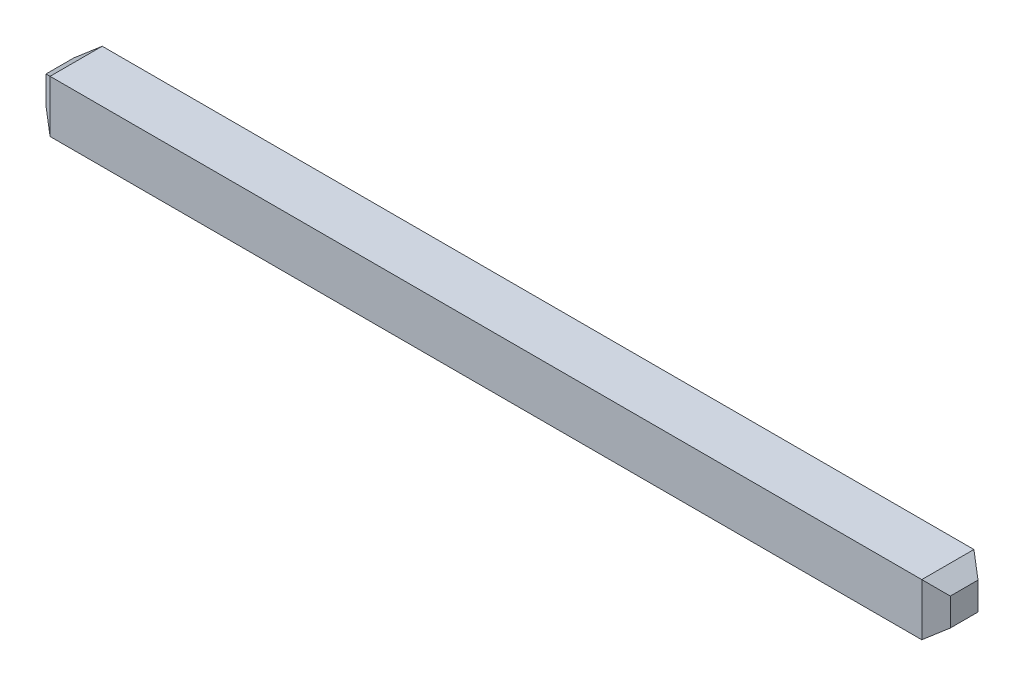
ISO-10303-21;
HEADER;
FILE_DESCRIPTION(('STEP AP214'),'2;1');
FILE_NAME('part.step','',(''),(''),'','','');
FILE_SCHEMA(('AUTOMOTIVE_DESIGN { 1 0 10303 214 1 1 1 1 }'));
ENDSEC;
DATA;
#1=APPLICATION_CONTEXT('core data for automotive mechanical design processes');
#2=APPLICATION_PROTOCOL_DEFINITION('international standard','automotive_design',2000,#1);
#3=PRODUCT_CONTEXT('',#1,'mechanical');
#4=PRODUCT('Part','Part','',(#3));
#5=PRODUCT_RELATED_PRODUCT_CATEGORY('part','',(#4));
#6=PRODUCT_DEFINITION_FORMATION('','',#4);
#7=PRODUCT_DEFINITION_CONTEXT('part definition',#1,'design');
#8=PRODUCT_DEFINITION('design','',#6,#7);
#9=PRODUCT_DEFINITION_SHAPE('','',#8);
#10=(LENGTH_UNIT() NAMED_UNIT(*) SI_UNIT(.MILLI.,.METRE.));
#11=(NAMED_UNIT(*) PLANE_ANGLE_UNIT() SI_UNIT($,.RADIAN.));
#12=(NAMED_UNIT(*) SI_UNIT($,.STERADIAN.) SOLID_ANGLE_UNIT());
#13=UNCERTAINTY_MEASURE_WITH_UNIT(LENGTH_MEASURE(1.E-05),#10,'distance_accuracy_value','');
#14=(GEOMETRIC_REPRESENTATION_CONTEXT(3) GLOBAL_UNCERTAINTY_ASSIGNED_CONTEXT((#13)) GLOBAL_UNIT_ASSIGNED_CONTEXT((#10,
#11,#12)) REPRESENTATION_CONTEXT('',''));
#15=CARTESIAN_POINT('',(0.,0.,0.));
#16=DIRECTION('',(0.,0.,1.));
#17=DIRECTION('',(1.,0.,0.));
#18=AXIS2_PLACEMENT_3D('',#15,#16,#17);
#19=CARTESIAN_POINT('',(-2.4,3.77,-39.615));
#20=DIRECTION('',(0.599999999990736,0.,0.800000000006948));
#21=DIRECTION('',(0.800000000006948,0.,-0.599999999990736));
#22=AXIS2_PLACEMENT_3D('',#19,#20,#21);
#23=PLANE('',#22);
#24=DIRECTION('',(0.,1.,0.));
#25=VECTOR('',#24,1.);
#26=CARTESIAN_POINT('',(-2.3,3.77,-39.69));
#27=LINE('',#26,#25);
#28=CARTESIAN_POINT('',(-2.29999999999957,4.09,-39.6899999999994));
#29=VERTEX_POINT('',#28);
#30=CARTESIAN_POINT('',(-2.29999999999957,3.45,-39.6899999999994));
#31=VERTEX_POINT('',#30);
#32=EDGE_CURVE('E101',#29,#31,#27,.F.);
#33=ORIENTED_EDGE('',*,*,#32,.T.);
#34=DIRECTION('',(-0.685994340570039,0.514495755427529,0.51449575542752));
#35=VECTOR('',#34,1.);
#36=CARTESIAN_POINT('',(-2.3,3.45,-39.69));
#37=LINE('',#36,#35);
#38=CARTESIAN_POINT('',(-2.50000000000022,3.6,-39.5400000000003));
#39=VERTEX_POINT('',#38);
#40=EDGE_CURVE('E85',#31,#39,#37,.T.);
#41=ORIENTED_EDGE('',*,*,#40,.T.);
#42=DIRECTION('',(0.,1.,0.));
#43=VECTOR('',#42,1.);
#44=CARTESIAN_POINT('',(-2.5,3.77,-39.54));
#45=LINE('',#44,#43);
#46=CARTESIAN_POINT('',(-2.50000000000044,3.94,-39.5400000000006));
#47=VERTEX_POINT('',#46);
#48=EDGE_CURVE('E79',#39,#47,#45,.T.);
#49=ORIENTED_EDGE('',*,*,#48,.T.);
#50=DIRECTION('',(-0.685994340570039,-0.514495755427529,0.51449575542752));
#51=VECTOR('',#50,1.);
#52=CARTESIAN_POINT('',(-2.3,4.09,-39.69));
#53=LINE('',#52,#51);
#54=EDGE_CURVE('E20',#29,#47,#53,.T.);
#55=ORIENTED_EDGE('',*,*,#54,.F.);
#56=EDGE_LOOP('',(#33,#41,#49,#55));
#57=FACE_BOUND('',#56,.T.);
#58=ADVANCED_FACE('F17',(#57),#23,.F.);
#59=CARTESIAN_POINT('',(8.5,3.77,-39.615));
#60=DIRECTION('',(-0.599999999990736,0.,0.800000000006948));
#61=DIRECTION('',(0.800000000006948,0.,0.599999999990736));
#62=AXIS2_PLACEMENT_3D('',#59,#60,#61);
#63=PLANE('',#62);
#64=DIRECTION('',(0.,1.,0.));
#65=VECTOR('',#64,1.);
#66=CARTESIAN_POINT('',(8.6,3.77,-39.54));
#67=LINE('',#66,#65);
#68=CARTESIAN_POINT('',(8.60000000000022,3.6,-39.5400000000003));
#69=VERTEX_POINT('',#68);
#70=CARTESIAN_POINT('',(8.60000000000044,3.94,-39.5400000000006));
#71=VERTEX_POINT('',#70);
#72=EDGE_CURVE('E113',#69,#71,#67,.T.);
#73=ORIENTED_EDGE('',*,*,#72,.F.);
#74=DIRECTION('',(-0.685994340570037,-0.514495755427528,-0.514495755427522));
#75=VECTOR('',#74,1.);
#76=CARTESIAN_POINT('',(8.6,3.6,-39.54));
#77=LINE('',#76,#75);
#78=CARTESIAN_POINT('',(8.39999999999957,3.45,-39.6899999999994));
#79=VERTEX_POINT('',#78);
#80=EDGE_CURVE('E108',#69,#79,#77,.T.);
#81=ORIENTED_EDGE('',*,*,#80,.T.);
#82=DIRECTION('',(0.,1.,0.));
#83=VECTOR('',#82,1.);
#84=CARTESIAN_POINT('',(8.4,3.77,-39.69));
#85=LINE('',#84,#83);
#86=CARTESIAN_POINT('',(8.39999999999957,4.09,-39.6899999999994));
#87=VERTEX_POINT('',#86);
#88=EDGE_CURVE('E99',#79,#87,#85,.T.);
#89=ORIENTED_EDGE('',*,*,#88,.T.);
#90=DIRECTION('',(-0.685994340570037,0.514495755427528,-0.514495755427522));
#91=VECTOR('',#90,1.);
#92=CARTESIAN_POINT('',(8.6,3.94,-39.54));
#93=LINE('',#92,#91);
#94=EDGE_CURVE('E116',#71,#87,#93,.T.);
#95=ORIENTED_EDGE('',*,*,#94,.F.);
#96=EDGE_LOOP('',(#73,#81,#89,#95));
#97=FACE_BOUND('',#96,.T.);
#98=ADVANCED_FACE('F214',(#97),#63,.F.);
#99=CARTESIAN_POINT('',(-2.4,4.015,-39.37));
#100=DIRECTION('',(-0.6,0.8,0.));
#101=DIRECTION('',(-0.8,-0.6,0.));
#102=AXIS2_PLACEMENT_3D('',#99,#100,#101);
#103=PLANE('',#102);
#104=DIRECTION('',(-0.685994340575995,-0.514495755427521,-0.514495755419586));
#105=VECTOR('',#104,1.);
#106=CARTESIAN_POINT('',(-2.29999999999913,4.09,-39.0500000000012));
#107=LINE('',#106,#105);
#108=CARTESIAN_POINT('',(-2.29999999999989,4.09,-39.0500000000001));
#109=VERTEX_POINT('',#108);
#110=CARTESIAN_POINT('',(-2.50000000000022,3.94,-39.1999999999997));
#111=VERTEX_POINT('',#110);
#112=EDGE_CURVE('E128',#109,#111,#107,.T.);
#113=ORIENTED_EDGE('',*,*,#112,.F.);
#114=DIRECTION('',(0.,0.,1.));
#115=VECTOR('',#114,1.);
#116=CARTESIAN_POINT('',(-2.3,4.09,-39.37));
#117=LINE('',#116,#115);
#118=EDGE_CURVE('E93',#29,#109,#117,.T.);
#119=ORIENTED_EDGE('',*,*,#118,.F.);
#120=ORIENTED_EDGE('',*,*,#54,.T.);
#121=DIRECTION('',(0.,0.,-1.));
#122=VECTOR('',#121,1.);
#123=CARTESIAN_POINT('',(-2.5,3.94,-39.37));
#124=LINE('',#123,#122);
#125=EDGE_CURVE('E87',#47,#111,#124,.F.);
#126=ORIENTED_EDGE('',*,*,#125,.T.);
#127=EDGE_LOOP('',(#113,#119,#120,#126));
#128=FACE_BOUND('',#127,.T.);
#129=ADVANCED_FACE('F90',(#128),#103,.T.);
#130=CARTESIAN_POINT('',(-2.5,3.77,-39.37));
#131=DIRECTION('',(1.,0.,0.));
#132=DIRECTION('',(0.,0.,-1.));
#133=AXIS2_PLACEMENT_3D('',#130,#131,#132);
#134=PLANE('',#133);
#135=DIRECTION('',(0.,1.,0.));
#136=VECTOR('',#135,1.);
#137=CARTESIAN_POINT('',(-2.50000000000087,3.77,-39.1999999999988));
#138=LINE('',#137,#136);
#139=CARTESIAN_POINT('',(-2.50000000000022,3.6,-39.1999999999997));
#140=VERTEX_POINT('',#139);
#141=EDGE_CURVE('E97',#111,#140,#138,.F.);
#142=ORIENTED_EDGE('',*,*,#141,.F.);
#143=ORIENTED_EDGE('',*,*,#125,.F.);
#144=ORIENTED_EDGE('',*,*,#48,.F.);
#145=DIRECTION('',(0.,0.,1.));
#146=VECTOR('',#145,1.);
#147=CARTESIAN_POINT('',(-2.5,3.6,-39.37));
#148=LINE('',#147,#146);
#149=EDGE_CURVE('E105',#39,#140,#148,.T.);
#150=ORIENTED_EDGE('',*,*,#149,.T.);
#151=EDGE_LOOP('',(#142,#143,#144,#150));
#152=FACE_BOUND('',#151,.T.);
#153=ADVANCED_FACE('F95',(#152),#134,.F.);
#154=CARTESIAN_POINT('',(3.05,3.77,-39.69));
#155=DIRECTION('',(0.,0.,1.));
#156=DIRECTION('',(1.,0.,0.));
#157=AXIS2_PLACEMENT_3D('',#154,#155,#156);
#158=PLANE('',#157);
#159=ORIENTED_EDGE('',*,*,#32,.F.);
#160=DIRECTION('',(1.,0.,0.));
#161=VECTOR('',#160,1.);
#162=CARTESIAN_POINT('',(3.05,4.09,-39.69));
#163=LINE('',#162,#161);
#164=EDGE_CURVE('E122',#87,#29,#163,.F.);
#165=ORIENTED_EDGE('',*,*,#164,.F.);
#166=ORIENTED_EDGE('',*,*,#88,.F.);
#167=DIRECTION('',(1.,0.,0.));
#168=VECTOR('',#167,1.);
#169=CARTESIAN_POINT('',(3.05,3.45,-39.69));
#170=LINE('',#169,#168);
#171=EDGE_CURVE('E136',#79,#31,#170,.F.);
#172=ORIENTED_EDGE('',*,*,#171,.T.);
#173=EDGE_LOOP('',(#159,#165,#166,#172));
#174=FACE_BOUND('',#173,.T.);
#175=ADVANCED_FACE('F182',(#174),#158,.F.);
#176=CARTESIAN_POINT('',(-2.4,3.525,-39.37));
#177=DIRECTION('',(0.6,0.8,0.));
#178=DIRECTION('',(-0.8,0.6,0.));
#179=AXIS2_PLACEMENT_3D('',#176,#177,#178);
#180=PLANE('',#179);
#181=DIRECTION('',(0.,0.,1.));
#182=VECTOR('',#181,1.);
#183=CARTESIAN_POINT('',(-2.3,3.45,-39.37));
#184=LINE('',#183,#182);
#185=CARTESIAN_POINT('',(-2.29999999999978,3.45,-39.0500000000003));
#186=VERTEX_POINT('',#185);
#187=EDGE_CURVE('E139',#31,#186,#184,.T.);
#188=ORIENTED_EDGE('',*,*,#187,.T.);
#189=DIRECTION('',(0.685994340575995,-0.514495755427521,0.514495755419586));
#190=VECTOR('',#189,1.);
#191=CARTESIAN_POINT('',(-2.50000000000087,3.6,-39.1999999999988));
#192=LINE('',#191,#190);
#193=EDGE_CURVE('E131',#140,#186,#192,.T.);
#194=ORIENTED_EDGE('',*,*,#193,.F.);
#195=ORIENTED_EDGE('',*,*,#149,.F.);
#196=ORIENTED_EDGE('',*,*,#40,.F.);
#197=EDGE_LOOP('',(#188,#194,#195,#196));
#198=FACE_BOUND('',#197,.T.);
#199=ADVANCED_FACE('F179',(#198),#180,.F.);
#200=CARTESIAN_POINT('',(8.5,3.525,-39.37));
#201=DIRECTION('',(-0.6,0.8,0.));
#202=DIRECTION('',(-0.8,-0.6,0.));
#203=AXIS2_PLACEMENT_3D('',#200,#201,#202);
#204=PLANE('',#203);
#205=DIRECTION('',(0.,0.,-1.));
#206=VECTOR('',#205,1.);
#207=CARTESIAN_POINT('',(8.6,3.6,-39.37));
#208=LINE('',#207,#206);
#209=CARTESIAN_POINT('',(8.60000000000022,3.6,-39.1999999999997));
#210=VERTEX_POINT('',#209);
#211=EDGE_CURVE('E110',#210,#69,#208,.T.);
#212=ORIENTED_EDGE('',*,*,#211,.F.);
#213=DIRECTION('',(0.685994340575993,0.514495755427522,-0.514495755419587));
#214=VECTOR('',#213,1.);
#215=CARTESIAN_POINT('',(8.39999999999913,3.45,-39.0500000000012));
#216=LINE('',#215,#214);
#217=CARTESIAN_POINT('',(8.39999999999989,3.45,-39.0500000000001));
#218=VERTEX_POINT('',#217);
#219=EDGE_CURVE('E35',#218,#210,#216,.T.);
#220=ORIENTED_EDGE('',*,*,#219,.F.);
#221=DIRECTION('',(0.,0.,1.));
#222=VECTOR('',#221,1.);
#223=CARTESIAN_POINT('',(8.4,3.45,-39.37));
#224=LINE('',#223,#222);
#225=EDGE_CURVE('E134',#218,#79,#224,.F.);
#226=ORIENTED_EDGE('',*,*,#225,.T.);
#227=ORIENTED_EDGE('',*,*,#80,.F.);
#228=EDGE_LOOP('',(#212,#220,#226,#227));
#229=FACE_BOUND('',#228,.T.);
#230=ADVANCED_FACE('F181',(#229),#204,.F.);
#231=CARTESIAN_POINT('',(8.6,3.77,-39.37));
#232=DIRECTION('',(1.,0.,0.));
#233=DIRECTION('',(0.,0.,-1.));
#234=AXIS2_PLACEMENT_3D('',#231,#232,#233);
#235=PLANE('',#234);
#236=ORIENTED_EDGE('',*,*,#72,.T.);
#237=DIRECTION('',(0.,0.,1.));
#238=VECTOR('',#237,1.);
#239=CARTESIAN_POINT('',(8.6,3.94,-39.37));
#240=LINE('',#239,#238);
#241=CARTESIAN_POINT('',(8.60000000000022,3.94,-39.1999999999997));
#242=VERTEX_POINT('',#241);
#243=EDGE_CURVE('E119',#242,#71,#240,.F.);
#244=ORIENTED_EDGE('',*,*,#243,.F.);
#245=DIRECTION('',(0.,1.,0.));
#246=VECTOR('',#245,1.);
#247=CARTESIAN_POINT('',(8.60000000000087,3.77,-39.1999999999988));
#248=LINE('',#247,#246);
#249=EDGE_CURVE('E142',#210,#242,#248,.T.);
#250=ORIENTED_EDGE('',*,*,#249,.F.);
#251=ORIENTED_EDGE('',*,*,#211,.T.);
#252=EDGE_LOOP('',(#236,#244,#250,#251));
#253=FACE_BOUND('',#252,.T.);
#254=ADVANCED_FACE('F189',(#253),#235,.T.);
#255=CARTESIAN_POINT('',(8.5,4.015,-39.37));
#256=DIRECTION('',(0.6,0.8,0.));
#257=DIRECTION('',(-0.8,0.6,0.));
#258=AXIS2_PLACEMENT_3D('',#255,#256,#257);
#259=PLANE('',#258);
#260=DIRECTION('',(-0.685994340575993,0.514495755427522,0.514495755419587));
#261=VECTOR('',#260,1.);
#262=CARTESIAN_POINT('',(8.60000000000087,3.94,-39.1999999999988));
#263=LINE('',#262,#261);
#264=CARTESIAN_POINT('',(8.39999999999989,4.09,-39.0500000000001));
#265=VERTEX_POINT('',#264);
#266=EDGE_CURVE('E145',#242,#265,#263,.T.);
#267=ORIENTED_EDGE('',*,*,#266,.F.);
#268=ORIENTED_EDGE('',*,*,#243,.T.);
#269=ORIENTED_EDGE('',*,*,#94,.T.);
#270=DIRECTION('',(0.,0.,1.));
#271=VECTOR('',#270,1.);
#272=CARTESIAN_POINT('',(8.4,4.09,-39.37));
#273=LINE('',#272,#271);
#274=EDGE_CURVE('E125',#265,#87,#273,.F.);
#275=ORIENTED_EDGE('',*,*,#274,.F.);
#276=EDGE_LOOP('',(#267,#268,#269,#275));
#277=FACE_BOUND('',#276,.T.);
#278=ADVANCED_FACE('F170',(#277),#259,.T.);
#279=CARTESIAN_POINT('',(3.05,4.09,-39.37));
#280=DIRECTION('',(0.,1.,0.));
#281=DIRECTION('',(0.,0.,1.));
#282=AXIS2_PLACEMENT_3D('',#279,#280,#281);
#283=PLANE('',#282);
#284=DIRECTION('',(1.,0.,0.));
#285=VECTOR('',#284,1.);
#286=CARTESIAN_POINT('',(3.05,4.09,-39.05));
#287=LINE('',#286,#285);
#288=EDGE_CURVE('E148',#265,#109,#287,.F.);
#289=ORIENTED_EDGE('',*,*,#288,.F.);
#290=ORIENTED_EDGE('',*,*,#274,.T.);
#291=ORIENTED_EDGE('',*,*,#164,.T.);
#292=ORIENTED_EDGE('',*,*,#118,.T.);
#293=EDGE_LOOP('',(#289,#290,#291,#292));
#294=FACE_BOUND('',#293,.T.);
#295=ADVANCED_FACE('F173',(#294),#283,.T.);
#296=CARTESIAN_POINT('',(-2.4,3.77,-39.125));
#297=DIRECTION('',(-0.599999999990736,0.,0.800000000006948));
#298=DIRECTION('',(0.800000000006948,0.,0.599999999990736));
#299=AXIS2_PLACEMENT_3D('',#296,#297,#298);
#300=PLANE('',#299);
#301=ORIENTED_EDGE('',*,*,#193,.T.);
#302=DIRECTION('',(0.,1.,0.));
#303=VECTOR('',#302,1.);
#304=CARTESIAN_POINT('',(-2.3,3.77,-39.05));
#305=LINE('',#304,#303);
#306=EDGE_CURVE('E151',#109,#186,#305,.F.);
#307=ORIENTED_EDGE('',*,*,#306,.F.);
#308=ORIENTED_EDGE('',*,*,#112,.T.);
#309=ORIENTED_EDGE('',*,*,#141,.T.);
#310=EDGE_LOOP('',(#301,#307,#308,#309));
#311=FACE_BOUND('',#310,.T.);
#312=ADVANCED_FACE('F176',(#311),#300,.T.);
#313=CARTESIAN_POINT('',(3.05,3.45,-39.37));
#314=DIRECTION('',(0.,1.,0.));
#315=DIRECTION('',(0.,0.,1.));
#316=AXIS2_PLACEMENT_3D('',#313,#314,#315);
#317=PLANE('',#316);
#318=ORIENTED_EDGE('',*,*,#187,.F.);
#319=ORIENTED_EDGE('',*,*,#171,.F.);
#320=ORIENTED_EDGE('',*,*,#225,.F.);
#321=DIRECTION('',(1.,0.,0.));
#322=VECTOR('',#321,1.);
#323=CARTESIAN_POINT('',(3.05,3.45,-39.05));
#324=LINE('',#323,#322);
#325=EDGE_CURVE('E26',#186,#218,#324,.T.);
#326=ORIENTED_EDGE('',*,*,#325,.F.);
#327=EDGE_LOOP('',(#318,#319,#320,#326));
#328=FACE_BOUND('',#327,.T.);
#329=ADVANCED_FACE('F162',(#328),#317,.F.);
#330=CARTESIAN_POINT('',(8.5,3.77,-39.125));
#331=DIRECTION('',(0.599999999990736,0.,0.800000000006948));
#332=DIRECTION('',(0.800000000006948,0.,-0.599999999990736));
#333=AXIS2_PLACEMENT_3D('',#330,#331,#332);
#334=PLANE('',#333);
#335=ORIENTED_EDGE('',*,*,#266,.T.);
#336=DIRECTION('',(0.,1.,0.));
#337=VECTOR('',#336,1.);
#338=CARTESIAN_POINT('',(8.4,3.77,-39.05));
#339=LINE('',#338,#337);
#340=EDGE_CURVE('E11',#218,#265,#339,.T.);
#341=ORIENTED_EDGE('',*,*,#340,.F.);
#342=ORIENTED_EDGE('',*,*,#219,.T.);
#343=ORIENTED_EDGE('',*,*,#249,.T.);
#344=EDGE_LOOP('',(#335,#341,#342,#343));
#345=FACE_BOUND('',#344,.T.);
#346=ADVANCED_FACE('F166',(#345),#334,.T.);
#347=CARTESIAN_POINT('',(3.05,3.77,-39.05));
#348=DIRECTION('',(0.,0.,1.));
#349=DIRECTION('',(1.,0.,0.));
#350=AXIS2_PLACEMENT_3D('',#347,#348,#349);
#351=PLANE('',#350);
#352=ORIENTED_EDGE('',*,*,#325,.T.);
#353=ORIENTED_EDGE('',*,*,#340,.T.);
#354=ORIENTED_EDGE('',*,*,#288,.T.);
#355=ORIENTED_EDGE('',*,*,#306,.T.);
#356=EDGE_LOOP('',(#352,#353,#354,#355));
#357=FACE_BOUND('',#356,.T.);
#358=ADVANCED_FACE('F157',(#357),#351,.T.);
#359=CLOSED_SHELL('',(#58,#98,#129,#153,#175,#199,#230,#254,#278,#295,#312,#329,#346,#358));
#360=MANIFOLD_SOLID_BREP('B1',#359);
#361=ADVANCED_BREP_SHAPE_REPRESENTATION('',(#18,#360),#14);
#362=SHAPE_DEFINITION_REPRESENTATION(#9,#361);
ENDSEC;
END-ISO-10303-21;
